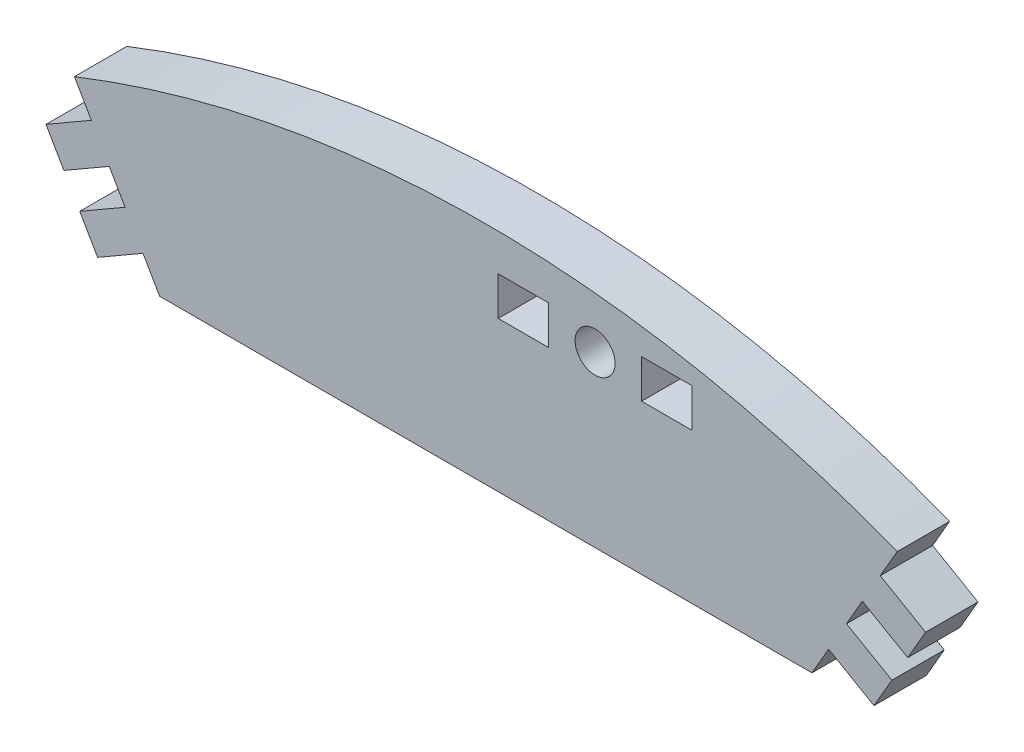
ISO-10303-21;
HEADER;
FILE_DESCRIPTION(('STEP AP214'),'2;1');
FILE_NAME('part.step','',(''),(''),'','','');
FILE_SCHEMA(('AUTOMOTIVE_DESIGN { 1 0 10303 214 1 1 1 1 }'));
ENDSEC;
DATA;
#1=APPLICATION_CONTEXT('core data for automotive mechanical design processes');
#2=APPLICATION_PROTOCOL_DEFINITION('international standard','automotive_design',2000,#1);
#3=PRODUCT_CONTEXT('',#1,'mechanical');
#4=PRODUCT('Part','Part','',(#3));
#5=PRODUCT_RELATED_PRODUCT_CATEGORY('part','',(#4));
#6=PRODUCT_DEFINITION_FORMATION('','',#4);
#7=PRODUCT_DEFINITION_CONTEXT('part definition',#1,'design');
#8=PRODUCT_DEFINITION('design','',#6,#7);
#9=PRODUCT_DEFINITION_SHAPE('','',#8);
#10=(LENGTH_UNIT() NAMED_UNIT(*) SI_UNIT(.MILLI.,.METRE.));
#11=(NAMED_UNIT(*) PLANE_ANGLE_UNIT() SI_UNIT($,.RADIAN.));
#12=(NAMED_UNIT(*) SI_UNIT($,.STERADIAN.) SOLID_ANGLE_UNIT());
#13=UNCERTAINTY_MEASURE_WITH_UNIT(LENGTH_MEASURE(1.E-05),#10,'distance_accuracy_value','');
#14=(GEOMETRIC_REPRESENTATION_CONTEXT(3) GLOBAL_UNCERTAINTY_ASSIGNED_CONTEXT((#13)) GLOBAL_UNIT_ASSIGNED_CONTEXT((#10,
#11,#12)) REPRESENTATION_CONTEXT('',''));
#15=CARTESIAN_POINT('',(0.,0.,0.));
#16=DIRECTION('',(0.,0.,1.));
#17=DIRECTION('',(1.,0.,0.));
#18=AXIS2_PLACEMENT_3D('',#15,#16,#17);
#19=CARTESIAN_POINT('',(0.,0.,5.15));
#20=DIRECTION('',(0.,0.,-1.));
#21=DIRECTION('',(-1.,0.,0.));
#22=AXIS2_PLACEMENT_3D('',#19,#20,#21);
#23=PLANE('',#22);
#24=DIRECTION('',(1.,0.,0.));
#25=VECTOR('',#24,1.);
#26=CARTESIAN_POINT('',(0.,106.45055836699,5.15));
#27=LINE('',#26,#25);
#28=CARTESIAN_POINT('',(1.21816936178716,106.45055836699,5.15));
#29=VERTEX_POINT('',#28);
#30=CARTESIAN_POINT('',(6.16816936178716,106.45055836699,5.15));
#31=VERTEX_POINT('',#30);
#32=EDGE_CURVE('E258',#29,#31,#27,.T.);
#33=ORIENTED_EDGE('',*,*,#32,.T.);
#34=DIRECTION('',(0.,-1.,0.));
#35=VECTOR('',#34,1.);
#36=CARTESIAN_POINT('',(6.16816936178713,0.,5.15));
#37=LINE('',#36,#35);
#38=CARTESIAN_POINT('',(6.16816936178716,102.65055836699,5.15));
#39=VERTEX_POINT('',#38);
#40=EDGE_CURVE('E264',#31,#39,#37,.T.);
#41=ORIENTED_EDGE('',*,*,#40,.T.);
#42=DIRECTION('',(1.,0.,0.));
#43=VECTOR('',#42,1.);
#44=CARTESIAN_POINT('',(0.,102.65055836699,5.15));
#45=LINE('',#44,#43);
#46=CARTESIAN_POINT('',(1.21816936178716,102.65055836699,5.15));
#47=VERTEX_POINT('',#46);
#48=EDGE_CURVE('E278',#47,#39,#45,.T.);
#49=ORIENTED_EDGE('',*,*,#48,.F.);
#50=DIRECTION('',(0.,-1.,0.));
#51=VECTOR('',#50,1.);
#52=CARTESIAN_POINT('',(1.21816936178716,0.,5.15));
#53=LINE('',#52,#51);
#54=EDGE_CURVE('E275',#29,#47,#53,.T.);
#55=ORIENTED_EDGE('',*,*,#54,.F.);
#56=EDGE_LOOP('',(#33,#41,#49,#55));
#57=FACE_BOUND('',#56,.T.);
#58=DIRECTION('',(0.499999999999999,-0.866025403784439,0.));
#59=VECTOR('',#58,1.);
#60=CARTESIAN_POINT('',(-32.057735026919,87.9,5.15));
#61=LINE('',#60,#59);
#62=CARTESIAN_POINT('',(-33.6943323793796,90.7346697659945,5.15));
#63=VERTEX_POINT('',#62);
#64=CARTESIAN_POINT('',(-32.057735026919,87.9,5.15));
#65=VERTEX_POINT('',#64);
#66=EDGE_CURVE('E293',#63,#65,#61,.T.);
#67=ORIENTED_EDGE('',*,*,#66,.T.);
#68=DIRECTION('',(1.,0.,0.));
#69=VECTOR('',#68,1.);
#70=CARTESIAN_POINT('',(-32.057735026919,87.9,5.15));
#71=LINE('',#70,#69);
#72=CARTESIAN_POINT('',(32.057735026919,87.9,5.15));
#73=VERTEX_POINT('',#72);
#74=EDGE_CURVE('E296',#65,#73,#71,.T.);
#75=ORIENTED_EDGE('',*,*,#74,.T.);
#76=DIRECTION('',(0.500000000000001,0.866025403784438,0.));
#77=VECTOR('',#76,1.);
#78=CARTESIAN_POINT('',(32.057735026919,87.9,5.15));
#79=LINE('',#78,#77);
#80=CARTESIAN_POINT('',(33.6943323793796,90.7346697659945,5.15));
#81=VERTEX_POINT('',#80);
#82=EDGE_CURVE('E299',#73,#81,#79,.T.);
#83=ORIENTED_EDGE('',*,*,#82,.T.);
#84=DIRECTION('',(0.866025403784439,-0.499999999999999,0.));
#85=VECTOR('',#84,1.);
#86=CARTESIAN_POINT('',(33.6943323793796,90.7346697659945,5.15));
#87=LINE('',#86,#85);
#88=CARTESIAN_POINT('',(38.1543632088694,88.1596697659945,5.15));
#89=VERTEX_POINT('',#88);
#90=EDGE_CURVE('E301',#81,#89,#87,.T.);
#91=ORIENTED_EDGE('',*,*,#90,.T.);
#92=DIRECTION('',(0.499999999999999,0.866025403784439,0.));
#93=VECTOR('',#92,1.);
#94=CARTESIAN_POINT('',(38.1543632088694,88.1596697659945,5.15));
#95=LINE('',#94,#93);
#96=CARTESIAN_POINT('',(39.9120930478705,91.2041471531243,5.15));
#97=VERTEX_POINT('',#96);
#98=EDGE_CURVE('E303',#89,#97,#95,.T.);
#99=ORIENTED_EDGE('',*,*,#98,.T.);
#100=DIRECTION('',(-0.866025403784438,0.5,0.));
#101=VECTOR('',#100,1.);
#102=CARTESIAN_POINT('',(39.9120930478705,91.2041471531243,5.15));
#103=LINE('',#102,#101);
#104=CARTESIAN_POINT('',(35.4520622183807,93.7791471531243,5.15));
#105=VERTEX_POINT('',#104);
#106=EDGE_CURVE('E305',#97,#105,#103,.T.);
#107=ORIENTED_EDGE('',*,*,#106,.T.);
#108=DIRECTION('',(0.5,0.866025403784438,0.));
#109=VECTOR('',#108,1.);
#110=CARTESIAN_POINT('',(35.4520622183807,93.7791471531243,5.15));
#111=LINE('',#110,#109);
#112=CARTESIAN_POINT('',(37.0097920573818,96.4772143787403,5.15));
#113=VERTEX_POINT('',#112);
#114=EDGE_CURVE('E307',#105,#113,#111,.T.);
#115=ORIENTED_EDGE('',*,*,#114,.T.);
#116=DIRECTION('',(0.866025403784438,-0.500000000000001,0.));
#117=VECTOR('',#116,1.);
#118=CARTESIAN_POINT('',(37.0097920573818,96.4772143787403,5.15));
#119=LINE('',#118,#117);
#120=CARTESIAN_POINT('',(41.4698228868716,93.9022143787403,5.15));
#121=VERTEX_POINT('',#120);
#122=EDGE_CURVE('E309',#113,#121,#119,.T.);
#123=ORIENTED_EDGE('',*,*,#122,.T.);
#124=DIRECTION('',(0.499999999999998,0.86602540378444,0.));
#125=VECTOR('',#124,1.);
#126=CARTESIAN_POINT('',(41.4698228868716,93.9022143787403,5.15));
#127=LINE('',#126,#125);
#128=CARTESIAN_POINT('',(43.2275527258728,96.9466917658701,5.15));
#129=VERTEX_POINT('',#128);
#130=EDGE_CURVE('E311',#121,#129,#127,.T.);
#131=ORIENTED_EDGE('',*,*,#130,.T.);
#132=DIRECTION('',(-0.866025403784439,0.499999999999999,0.));
#133=VECTOR('',#132,1.);
#134=CARTESIAN_POINT('',(43.2275527258728,96.9466917658701,5.15));
#135=LINE('',#134,#133);
#136=CARTESIAN_POINT('',(38.7675218963829,99.5216917658701,5.15));
#137=VERTEX_POINT('',#136);
#138=EDGE_CURVE('E313',#129,#137,#135,.T.);
#139=ORIENTED_EDGE('',*,*,#138,.T.);
#140=DIRECTION('',(0.499999999999998,0.86602540378444,0.));
#141=VECTOR('',#140,1.);
#142=CARTESIAN_POINT('',(38.7675218963829,99.5216917658701,5.15));
#143=LINE('',#142,#141);
#144=CARTESIAN_POINT('',(40.4332638413848,102.406841446912,5.15));
#145=VERTEX_POINT('',#144);
#146=EDGE_CURVE('E315',#137,#145,#143,.T.);
#147=ORIENTED_EDGE('',*,*,#146,.T.);
#148=CARTESIAN_POINT('',(0.,0.,5.15));
#149=DIRECTION('',(0.,0.,1.));
#150=DIRECTION('',(-1.,0.,0.));
#151=AXIS2_PLACEMENT_3D('',#148,#149,#150);
#152=CIRCLE('',#151,110.1);
#153=CARTESIAN_POINT('',(-40.4332638413848,102.406841446912,5.15));
#154=VERTEX_POINT('',#153);
#155=EDGE_CURVE('E317',#145,#154,#152,.T.);
#156=ORIENTED_EDGE('',*,*,#155,.T.);
#157=DIRECTION('',(0.499999999999998,-0.86602540378444,0.));
#158=VECTOR('',#157,1.);
#159=CARTESIAN_POINT('',(-38.7675218963829,99.5216917658701,5.15));
#160=LINE('',#159,#158);
#161=CARTESIAN_POINT('',(-38.7675218963829,99.5216917658701,5.15));
#162=VERTEX_POINT('',#161);
#163=EDGE_CURVE('E319',#154,#162,#160,.T.);
#164=ORIENTED_EDGE('',*,*,#163,.T.);
#165=DIRECTION('',(-0.866025403784439,-0.499999999999999,0.));
#166=VECTOR('',#165,1.);
#167=CARTESIAN_POINT('',(-43.2275527258728,96.9466917658701,5.15));
#168=LINE('',#167,#166);
#169=CARTESIAN_POINT('',(-43.2275527258728,96.9466917658701,5.15));
#170=VERTEX_POINT('',#169);
#171=EDGE_CURVE('E321',#162,#170,#168,.T.);
#172=ORIENTED_EDGE('',*,*,#171,.T.);
#173=DIRECTION('',(0.499999999999998,-0.86602540378444,0.));
#174=VECTOR('',#173,1.);
#175=CARTESIAN_POINT('',(-41.4698228868716,93.9022143787403,5.15));
#176=LINE('',#175,#174);
#177=CARTESIAN_POINT('',(-41.4698228868716,93.9022143787403,5.15));
#178=VERTEX_POINT('',#177);
#179=EDGE_CURVE('E323',#170,#178,#176,.T.);
#180=ORIENTED_EDGE('',*,*,#179,.T.);
#181=DIRECTION('',(0.866025403784438,0.500000000000001,0.));
#182=VECTOR('',#181,1.);
#183=CARTESIAN_POINT('',(-37.0097920573818,96.4772143787403,5.15));
#184=LINE('',#183,#182);
#185=CARTESIAN_POINT('',(-37.0097920573818,96.4772143787403,5.15));
#186=VERTEX_POINT('',#185);
#187=EDGE_CURVE('E325',#178,#186,#184,.T.);
#188=ORIENTED_EDGE('',*,*,#187,.T.);
#189=DIRECTION('',(0.5,-0.866025403784438,0.));
#190=VECTOR('',#189,1.);
#191=CARTESIAN_POINT('',(-35.4520622183807,93.7791471531243,5.15));
#192=LINE('',#191,#190);
#193=CARTESIAN_POINT('',(-35.4520622183807,93.7791471531243,5.15));
#194=VERTEX_POINT('',#193);
#195=EDGE_CURVE('E327',#186,#194,#192,.T.);
#196=ORIENTED_EDGE('',*,*,#195,.T.);
#197=DIRECTION('',(-0.866025403784438,-0.5,0.));
#198=VECTOR('',#197,1.);
#199=CARTESIAN_POINT('',(-39.9120930478705,91.2041471531243,5.15));
#200=LINE('',#199,#198);
#201=CARTESIAN_POINT('',(-39.9120930478705,91.2041471531243,5.15));
#202=VERTEX_POINT('',#201);
#203=EDGE_CURVE('E329',#194,#202,#200,.T.);
#204=ORIENTED_EDGE('',*,*,#203,.T.);
#205=DIRECTION('',(0.499999999999999,-0.866025403784439,0.));
#206=VECTOR('',#205,1.);
#207=CARTESIAN_POINT('',(-38.1543632088694,88.1596697659945,5.15));
#208=LINE('',#207,#206);
#209=CARTESIAN_POINT('',(-38.1543632088694,88.1596697659945,5.15));
#210=VERTEX_POINT('',#209);
#211=EDGE_CURVE('E331',#202,#210,#208,.T.);
#212=ORIENTED_EDGE('',*,*,#211,.T.);
#213=DIRECTION('',(0.866025403784438,0.500000000000001,0.));
#214=VECTOR('',#213,1.);
#215=CARTESIAN_POINT('',(-33.6943323793796,90.7346697659945,5.15));
#216=LINE('',#215,#214);
#217=EDGE_CURVE('E333',#210,#63,#216,.T.);
#218=ORIENTED_EDGE('',*,*,#217,.T.);
#219=EDGE_LOOP('',(#67,#75,#83,#91,#99,#107,#115,#123,#131,#139,#147,#156,#164,#172,#180,#188,
#196,#204,#212,#218));
#220=FACE_BOUND('',#219,.T.);
#221=CARTESIAN_POINT('',(10.74,104.55055836699,5.15));
#222=DIRECTION('',(0.,0.,1.));
#223=DIRECTION('',(1.,0.,0.));
#224=AXIS2_PLACEMENT_3D('',#221,#222,#223);
#225=CIRCLE('',#224,1.96749999999999);
#226=CARTESIAN_POINT('',(12.7075,104.55055836699,5.15));
#227=VERTEX_POINT('',#226);
#228=EDGE_CURVE('E251',#227,#227,#225,.T.);
#229=ORIENTED_EDGE('',*,*,#228,.F.);
#230=EDGE_LOOP('',(#229));
#231=FACE_BOUND('',#230,.T.);
#232=DIRECTION('',(1.,0.,0.));
#233=VECTOR('',#232,1.);
#234=CARTESIAN_POINT('',(0.,106.45055836699,5.15));
#235=LINE('',#234,#233);
#236=CARTESIAN_POINT('',(15.3118306382128,106.45055836699,5.15));
#237=VERTEX_POINT('',#236);
#238=CARTESIAN_POINT('',(20.2618306382128,106.45055836699,5.15));
#239=VERTEX_POINT('',#238);
#240=EDGE_CURVE('E48',#237,#239,#235,.T.);
#241=ORIENTED_EDGE('',*,*,#240,.T.);
#242=DIRECTION('',(0.,-1.,0.));
#243=VECTOR('',#242,1.);
#244=CARTESIAN_POINT('',(20.2618306382128,0.,5.15));
#245=LINE('',#244,#243);
#246=CARTESIAN_POINT('',(20.2618306382128,102.65055836699,5.15));
#247=VERTEX_POINT('',#246);
#248=EDGE_CURVE('E236',#239,#247,#245,.T.);
#249=ORIENTED_EDGE('',*,*,#248,.T.);
#250=DIRECTION('',(1.,0.,0.));
#251=VECTOR('',#250,1.);
#252=CARTESIAN_POINT('',(0.,102.65055836699,5.15));
#253=LINE('',#252,#251);
#254=CARTESIAN_POINT('',(15.3118306382128,102.65055836699,5.15));
#255=VERTEX_POINT('',#254);
#256=EDGE_CURVE('E239',#255,#247,#253,.T.);
#257=ORIENTED_EDGE('',*,*,#256,.F.);
#258=DIRECTION('',(0.,-1.,0.));
#259=VECTOR('',#258,1.);
#260=CARTESIAN_POINT('',(15.3118306382128,0.,5.15));
#261=LINE('',#260,#259);
#262=EDGE_CURVE('E245',#237,#255,#261,.T.);
#263=ORIENTED_EDGE('',*,*,#262,.F.);
#264=EDGE_LOOP('',(#241,#249,#257,#263));
#265=FACE_BOUND('',#264,.T.);
#266=ADVANCED_FACE('F33',(#57,#220,#231,#265),#23,.F.);
#267=CARTESIAN_POINT('',(0.,0.,0.));
#268=DIRECTION('',(0.,0.,-1.));
#269=DIRECTION('',(-1.,0.,0.));
#270=AXIS2_PLACEMENT_3D('',#267,#268,#269);
#271=PLANE('',#270);
#272=DIRECTION('',(0.,-1.,0.));
#273=VECTOR('',#272,1.);
#274=CARTESIAN_POINT('',(6.16816936178713,0.,0.));
#275=LINE('',#274,#273);
#276=CARTESIAN_POINT('',(6.16816936178716,106.45055836699,0.));
#277=VERTEX_POINT('',#276);
#278=CARTESIAN_POINT('',(6.16816936178716,102.65055836699,0.));
#279=VERTEX_POINT('',#278);
#280=EDGE_CURVE('E270',#277,#279,#275,.T.);
#281=ORIENTED_EDGE('',*,*,#280,.F.);
#282=DIRECTION('',(1.,0.,0.));
#283=VECTOR('',#282,1.);
#284=CARTESIAN_POINT('',(0.,106.45055836699,0.));
#285=LINE('',#284,#283);
#286=CARTESIAN_POINT('',(1.21816936178716,106.45055836699,0.));
#287=VERTEX_POINT('',#286);
#288=EDGE_CURVE('E261',#287,#277,#285,.T.);
#289=ORIENTED_EDGE('',*,*,#288,.F.);
#290=DIRECTION('',(0.,-1.,0.));
#291=VECTOR('',#290,1.);
#292=CARTESIAN_POINT('',(1.21816936178716,0.,0.));
#293=LINE('',#292,#291);
#294=CARTESIAN_POINT('',(1.21816936178716,102.65055836699,0.));
#295=VERTEX_POINT('',#294);
#296=EDGE_CURVE('E263',#287,#295,#293,.T.);
#297=ORIENTED_EDGE('',*,*,#296,.T.);
#298=DIRECTION('',(1.,0.,0.));
#299=VECTOR('',#298,1.);
#300=CARTESIAN_POINT('',(0.,102.65055836699,0.));
#301=LINE('',#300,#299);
#302=EDGE_CURVE('E267',#295,#279,#301,.T.);
#303=ORIENTED_EDGE('',*,*,#302,.T.);
#304=EDGE_LOOP('',(#281,#289,#297,#303));
#305=FACE_BOUND('',#304,.T.);
#306=DIRECTION('',(0.499999999999999,-0.866025403784439,0.));
#307=VECTOR('',#306,1.);
#308=CARTESIAN_POINT('',(-32.057735026919,87.9,0.));
#309=LINE('',#308,#307);
#310=CARTESIAN_POINT('',(-33.6943323793796,90.7346697659945,0.));
#311=VERTEX_POINT('',#310);
#312=CARTESIAN_POINT('',(-32.057735026919,87.9,0.));
#313=VERTEX_POINT('',#312);
#314=EDGE_CURVE('E286',#311,#313,#309,.T.);
#315=ORIENTED_EDGE('',*,*,#314,.F.);
#316=DIRECTION('',(0.866025403784438,0.500000000000001,0.));
#317=VECTOR('',#316,1.);
#318=CARTESIAN_POINT('',(-33.6943323793796,90.7346697659945,0.));
#319=LINE('',#318,#317);
#320=CARTESIAN_POINT('',(-38.1543632088694,88.1596697659945,0.));
#321=VERTEX_POINT('',#320);
#322=EDGE_CURVE('E297',#321,#311,#319,.T.);
#323=ORIENTED_EDGE('',*,*,#322,.F.);
#324=DIRECTION('',(0.499999999999999,-0.866025403784439,0.));
#325=VECTOR('',#324,1.);
#326=CARTESIAN_POINT('',(-38.1543632088694,88.1596697659945,0.));
#327=LINE('',#326,#325);
#328=CARTESIAN_POINT('',(-39.9120930478705,91.2041471531243,0.));
#329=VERTEX_POINT('',#328);
#330=EDGE_CURVE('E372',#329,#321,#327,.T.);
#331=ORIENTED_EDGE('',*,*,#330,.F.);
#332=DIRECTION('',(-0.866025403784438,-0.5,0.));
#333=VECTOR('',#332,1.);
#334=CARTESIAN_POINT('',(-39.9120930478705,91.2041471531243,0.));
#335=LINE('',#334,#333);
#336=CARTESIAN_POINT('',(-35.4520622183807,93.7791471531243,0.));
#337=VERTEX_POINT('',#336);
#338=EDGE_CURVE('E370',#337,#329,#335,.T.);
#339=ORIENTED_EDGE('',*,*,#338,.F.);
#340=DIRECTION('',(0.5,-0.866025403784438,0.));
#341=VECTOR('',#340,1.);
#342=CARTESIAN_POINT('',(-35.4520622183807,93.7791471531243,0.));
#343=LINE('',#342,#341);
#344=CARTESIAN_POINT('',(-37.0097920573818,96.4772143787403,0.));
#345=VERTEX_POINT('',#344);
#346=EDGE_CURVE('E368',#345,#337,#343,.T.);
#347=ORIENTED_EDGE('',*,*,#346,.F.);
#348=DIRECTION('',(0.866025403784438,0.500000000000001,0.));
#349=VECTOR('',#348,1.);
#350=CARTESIAN_POINT('',(-37.0097920573818,96.4772143787403,0.));
#351=LINE('',#350,#349);
#352=CARTESIAN_POINT('',(-41.4698228868716,93.9022143787403,0.));
#353=VERTEX_POINT('',#352);
#354=EDGE_CURVE('E366',#353,#345,#351,.T.);
#355=ORIENTED_EDGE('',*,*,#354,.F.);
#356=DIRECTION('',(0.499999999999998,-0.86602540378444,0.));
#357=VECTOR('',#356,1.);
#358=CARTESIAN_POINT('',(-41.4698228868716,93.9022143787403,0.));
#359=LINE('',#358,#357);
#360=CARTESIAN_POINT('',(-43.2275527258728,96.9466917658701,0.));
#361=VERTEX_POINT('',#360);
#362=EDGE_CURVE('E364',#361,#353,#359,.T.);
#363=ORIENTED_EDGE('',*,*,#362,.F.);
#364=DIRECTION('',(-0.866025403784439,-0.499999999999999,0.));
#365=VECTOR('',#364,1.);
#366=CARTESIAN_POINT('',(-43.2275527258728,96.9466917658701,0.));
#367=LINE('',#366,#365);
#368=CARTESIAN_POINT('',(-38.7675218963829,99.5216917658701,0.));
#369=VERTEX_POINT('',#368);
#370=EDGE_CURVE('E362',#369,#361,#367,.T.);
#371=ORIENTED_EDGE('',*,*,#370,.F.);
#372=DIRECTION('',(0.499999999999998,-0.86602540378444,0.));
#373=VECTOR('',#372,1.);
#374=CARTESIAN_POINT('',(-38.7675218963829,99.5216917658701,0.));
#375=LINE('',#374,#373);
#376=CARTESIAN_POINT('',(-40.4332638413848,102.406841446912,0.));
#377=VERTEX_POINT('',#376);
#378=EDGE_CURVE('E360',#377,#369,#375,.T.);
#379=ORIENTED_EDGE('',*,*,#378,.F.);
#380=CARTESIAN_POINT('',(0.,0.,0.));
#381=DIRECTION('',(0.,0.,1.));
#382=DIRECTION('',(-1.,0.,0.));
#383=AXIS2_PLACEMENT_3D('',#380,#381,#382);
#384=CIRCLE('',#383,110.1);
#385=CARTESIAN_POINT('',(40.4332638413848,102.406841446912,0.));
#386=VERTEX_POINT('',#385);
#387=EDGE_CURVE('E358',#386,#377,#384,.T.);
#388=ORIENTED_EDGE('',*,*,#387,.F.);
#389=DIRECTION('',(0.499999999999998,0.86602540378444,0.));
#390=VECTOR('',#389,1.);
#391=CARTESIAN_POINT('',(38.7675218963829,99.5216917658701,0.));
#392=LINE('',#391,#390);
#393=CARTESIAN_POINT('',(38.7675218963829,99.5216917658701,0.));
#394=VERTEX_POINT('',#393);
#395=EDGE_CURVE('E356',#394,#386,#392,.T.);
#396=ORIENTED_EDGE('',*,*,#395,.F.);
#397=DIRECTION('',(-0.866025403784439,0.499999999999999,0.));
#398=VECTOR('',#397,1.);
#399=CARTESIAN_POINT('',(43.2275527258728,96.9466917658701,0.));
#400=LINE('',#399,#398);
#401=CARTESIAN_POINT('',(43.2275527258728,96.9466917658701,0.));
#402=VERTEX_POINT('',#401);
#403=EDGE_CURVE('E354',#402,#394,#400,.T.);
#404=ORIENTED_EDGE('',*,*,#403,.F.);
#405=DIRECTION('',(0.499999999999998,0.86602540378444,0.));
#406=VECTOR('',#405,1.);
#407=CARTESIAN_POINT('',(41.4698228868716,93.9022143787403,0.));
#408=LINE('',#407,#406);
#409=CARTESIAN_POINT('',(41.4698228868716,93.9022143787403,0.));
#410=VERTEX_POINT('',#409);
#411=EDGE_CURVE('E352',#410,#402,#408,.T.);
#412=ORIENTED_EDGE('',*,*,#411,.F.);
#413=DIRECTION('',(0.866025403784438,-0.500000000000001,0.));
#414=VECTOR('',#413,1.);
#415=CARTESIAN_POINT('',(37.0097920573818,96.4772143787403,0.));
#416=LINE('',#415,#414);
#417=CARTESIAN_POINT('',(37.0097920573818,96.4772143787403,0.));
#418=VERTEX_POINT('',#417);
#419=EDGE_CURVE('E350',#418,#410,#416,.T.);
#420=ORIENTED_EDGE('',*,*,#419,.F.);
#421=DIRECTION('',(0.5,0.866025403784438,0.));
#422=VECTOR('',#421,1.);
#423=CARTESIAN_POINT('',(35.4520622183807,93.7791471531243,0.));
#424=LINE('',#423,#422);
#425=CARTESIAN_POINT('',(35.4520622183807,93.7791471531243,0.));
#426=VERTEX_POINT('',#425);
#427=EDGE_CURVE('E348',#426,#418,#424,.T.);
#428=ORIENTED_EDGE('',*,*,#427,.F.);
#429=DIRECTION('',(-0.866025403784438,0.5,0.));
#430=VECTOR('',#429,1.);
#431=CARTESIAN_POINT('',(39.9120930478705,91.2041471531243,0.));
#432=LINE('',#431,#430);
#433=CARTESIAN_POINT('',(39.9120930478705,91.2041471531243,0.));
#434=VERTEX_POINT('',#433);
#435=EDGE_CURVE('E346',#434,#426,#432,.T.);
#436=ORIENTED_EDGE('',*,*,#435,.F.);
#437=DIRECTION('',(0.499999999999999,0.866025403784439,0.));
#438=VECTOR('',#437,1.);
#439=CARTESIAN_POINT('',(38.1543632088694,88.1596697659945,0.));
#440=LINE('',#439,#438);
#441=CARTESIAN_POINT('',(38.1543632088694,88.1596697659945,0.));
#442=VERTEX_POINT('',#441);
#443=EDGE_CURVE('E344',#442,#434,#440,.T.);
#444=ORIENTED_EDGE('',*,*,#443,.F.);
#445=DIRECTION('',(0.866025403784439,-0.499999999999999,0.));
#446=VECTOR('',#445,1.);
#447=CARTESIAN_POINT('',(33.6943323793796,90.7346697659945,0.));
#448=LINE('',#447,#446);
#449=CARTESIAN_POINT('',(33.6943323793796,90.7346697659945,0.));
#450=VERTEX_POINT('',#449);
#451=EDGE_CURVE('E342',#450,#442,#448,.T.);
#452=ORIENTED_EDGE('',*,*,#451,.F.);
#453=DIRECTION('',(0.500000000000001,0.866025403784438,0.));
#454=VECTOR('',#453,1.);
#455=CARTESIAN_POINT('',(32.057735026919,87.9,0.));
#456=LINE('',#455,#454);
#457=CARTESIAN_POINT('',(32.057735026919,87.9,0.));
#458=VERTEX_POINT('',#457);
#459=EDGE_CURVE('E340',#458,#450,#456,.T.);
#460=ORIENTED_EDGE('',*,*,#459,.F.);
#461=DIRECTION('',(1.,0.,0.));
#462=VECTOR('',#461,1.);
#463=CARTESIAN_POINT('',(-32.057735026919,87.9,0.));
#464=LINE('',#463,#462);
#465=EDGE_CURVE('E338',#313,#458,#464,.T.);
#466=ORIENTED_EDGE('',*,*,#465,.F.);
#467=EDGE_LOOP('',(#315,#323,#331,#339,#347,#355,#363,#371,#379,#388,#396,#404,#412,#420,#428,
#436,#444,#452,#460,#466));
#468=FACE_BOUND('',#467,.T.);
#469=CARTESIAN_POINT('',(10.74,104.55055836699,0.));
#470=DIRECTION('',(0.,0.,1.));
#471=DIRECTION('',(1.,0.,0.));
#472=AXIS2_PLACEMENT_3D('',#469,#470,#471);
#473=CIRCLE('',#472,1.96749999999999);
#474=CARTESIAN_POINT('',(12.7075,104.55055836699,0.));
#475=VERTEX_POINT('',#474);
#476=EDGE_CURVE('E255',#475,#475,#473,.T.);
#477=ORIENTED_EDGE('',*,*,#476,.T.);
#478=EDGE_LOOP('',(#477));
#479=FACE_BOUND('',#478,.T.);
#480=DIRECTION('',(0.,-1.,0.));
#481=VECTOR('',#480,1.);
#482=CARTESIAN_POINT('',(20.2618306382128,0.,0.));
#483=LINE('',#482,#481);
#484=CARTESIAN_POINT('',(20.2618306382128,106.45055836699,0.));
#485=VERTEX_POINT('',#484);
#486=CARTESIAN_POINT('',(20.2618306382128,102.65055836699,0.));
#487=VERTEX_POINT('',#486);
#488=EDGE_CURVE('E227',#485,#487,#483,.T.);
#489=ORIENTED_EDGE('',*,*,#488,.F.);
#490=DIRECTION('',(1.,0.,0.));
#491=VECTOR('',#490,1.);
#492=CARTESIAN_POINT('',(0.,106.45055836699,0.));
#493=LINE('',#492,#491);
#494=CARTESIAN_POINT('',(15.3118306382128,106.45055836699,0.));
#495=VERTEX_POINT('',#494);
#496=EDGE_CURVE('E221',#495,#485,#493,.T.);
#497=ORIENTED_EDGE('',*,*,#496,.F.);
#498=DIRECTION('',(0.,-1.,0.));
#499=VECTOR('',#498,1.);
#500=CARTESIAN_POINT('',(15.3118306382128,0.,0.));
#501=LINE('',#500,#499);
#502=CARTESIAN_POINT('',(15.3118306382128,102.65055836699,0.));
#503=VERTEX_POINT('',#502);
#504=EDGE_CURVE('E230',#495,#503,#501,.T.);
#505=ORIENTED_EDGE('',*,*,#504,.T.);
#506=DIRECTION('',(1.,0.,0.));
#507=VECTOR('',#506,1.);
#508=CARTESIAN_POINT('',(0.,102.65055836699,0.));
#509=LINE('',#508,#507);
#510=EDGE_CURVE('E56',#503,#487,#509,.T.);
#511=ORIENTED_EDGE('',*,*,#510,.T.);
#512=EDGE_LOOP('',(#489,#497,#505,#511));
#513=FACE_BOUND('',#512,.T.);
#514=ADVANCED_FACE('F235',(#305,#468,#479,#513),#271,.T.);
#515=CARTESIAN_POINT('',(-32.057735026919,87.9,5.15));
#516=DIRECTION('',(0.866025403784439,0.499999999999999,0.));
#517=DIRECTION('',(-0.499999999999999,0.866025403784439,0.));
#518=AXIS2_PLACEMENT_3D('',#515,#516,#517);
#519=PLANE('',#518);
#520=ORIENTED_EDGE('',*,*,#314,.T.);
#521=DIRECTION('',(0.,0.,-1.));
#522=VECTOR('',#521,1.);
#523=CARTESIAN_POINT('',(-32.057735026919,87.9,5.15));
#524=LINE('',#523,#522);
#525=EDGE_CURVE('E11',#65,#313,#524,.T.);
#526=ORIENTED_EDGE('',*,*,#525,.F.);
#527=ORIENTED_EDGE('',*,*,#66,.F.);
#528=DIRECTION('',(0.,0.,-1.));
#529=VECTOR('',#528,1.);
#530=CARTESIAN_POINT('',(-33.6943323793796,90.7346697659945,5.15));
#531=LINE('',#530,#529);
#532=EDGE_CURVE('E335',#63,#311,#531,.T.);
#533=ORIENTED_EDGE('',*,*,#532,.T.);
#534=EDGE_LOOP('',(#520,#526,#527,#533));
#535=FACE_BOUND('',#534,.T.);
#536=ADVANCED_FACE('F35',(#535),#519,.F.);
#537=CARTESIAN_POINT('',(-32.057735026919,87.9,5.15));
#538=DIRECTION('',(0.,1.,0.));
#539=DIRECTION('',(0.,0.,1.));
#540=AXIS2_PLACEMENT_3D('',#537,#538,#539);
#541=PLANE('',#540);
#542=ORIENTED_EDGE('',*,*,#465,.T.);
#543=DIRECTION('',(0.,0.,-1.));
#544=VECTOR('',#543,1.);
#545=CARTESIAN_POINT('',(32.057735026919,87.9,5.15));
#546=LINE('',#545,#544);
#547=EDGE_CURVE('E41',#73,#458,#546,.T.);
#548=ORIENTED_EDGE('',*,*,#547,.F.);
#549=ORIENTED_EDGE('',*,*,#74,.F.);
#550=ORIENTED_EDGE('',*,*,#525,.T.);
#551=EDGE_LOOP('',(#542,#548,#549,#550));
#552=FACE_BOUND('',#551,.T.);
#553=ADVANCED_FACE('F455',(#552),#541,.F.);
#554=CARTESIAN_POINT('',(32.057735026919,87.9,5.15));
#555=DIRECTION('',(-0.866025403784438,0.500000000000001,0.));
#556=DIRECTION('',(-0.500000000000001,-0.866025403784438,0.));
#557=AXIS2_PLACEMENT_3D('',#554,#555,#556);
#558=PLANE('',#557);
#559=ORIENTED_EDGE('',*,*,#459,.T.);
#560=DIRECTION('',(0.,0.,-1.));
#561=VECTOR('',#560,1.);
#562=CARTESIAN_POINT('',(33.6943323793796,90.7346697659945,5.15));
#563=LINE('',#562,#561);
#564=EDGE_CURVE('E425',#81,#450,#563,.T.);
#565=ORIENTED_EDGE('',*,*,#564,.F.);
#566=ORIENTED_EDGE('',*,*,#82,.F.);
#567=ORIENTED_EDGE('',*,*,#547,.T.);
#568=EDGE_LOOP('',(#559,#565,#566,#567));
#569=FACE_BOUND('',#568,.T.);
#570=ADVANCED_FACE('F432',(#569),#558,.F.);
#571=CARTESIAN_POINT('',(33.6943323793796,90.7346697659945,5.15));
#572=DIRECTION('',(0.499999999999999,0.866025403784439,0.));
#573=DIRECTION('',(-0.866025403784439,0.5,0.));
#574=AXIS2_PLACEMENT_3D('',#571,#572,#573);
#575=PLANE('',#574);
#576=ORIENTED_EDGE('',*,*,#451,.T.);
#577=DIRECTION('',(0.,0.,-1.));
#578=VECTOR('',#577,1.);
#579=CARTESIAN_POINT('',(38.1543632088694,88.1596697659945,5.15));
#580=LINE('',#579,#578);
#581=EDGE_CURVE('E422',#89,#442,#580,.T.);
#582=ORIENTED_EDGE('',*,*,#581,.F.);
#583=ORIENTED_EDGE('',*,*,#90,.F.);
#584=ORIENTED_EDGE('',*,*,#564,.T.);
#585=EDGE_LOOP('',(#576,#582,#583,#584));
#586=FACE_BOUND('',#585,.T.);
#587=ADVANCED_FACE('F443',(#586),#575,.F.);
#588=CARTESIAN_POINT('',(38.1543632088694,88.1596697659945,5.15));
#589=DIRECTION('',(-0.866025403784439,0.499999999999999,0.));
#590=DIRECTION('',(-0.5,-0.866025403784439,0.));
#591=AXIS2_PLACEMENT_3D('',#588,#589,#590);
#592=PLANE('',#591);
#593=ORIENTED_EDGE('',*,*,#443,.T.);
#594=DIRECTION('',(0.,0.,-1.));
#595=VECTOR('',#594,1.);
#596=CARTESIAN_POINT('',(39.9120930478705,91.2041471531243,5.15));
#597=LINE('',#596,#595);
#598=EDGE_CURVE('E419',#97,#434,#597,.T.);
#599=ORIENTED_EDGE('',*,*,#598,.F.);
#600=ORIENTED_EDGE('',*,*,#98,.F.);
#601=ORIENTED_EDGE('',*,*,#581,.T.);
#602=EDGE_LOOP('',(#593,#599,#600,#601));
#603=FACE_BOUND('',#602,.T.);
#604=ADVANCED_FACE('F447',(#603),#592,.F.);
#605=CARTESIAN_POINT('',(39.9120930478705,91.2041471531243,5.15));
#606=DIRECTION('',(-0.5,-0.866025403784438,0.));
#607=DIRECTION('',(0.866025403784439,-0.5,0.));
#608=AXIS2_PLACEMENT_3D('',#605,#606,#607);
#609=PLANE('',#608);
#610=ORIENTED_EDGE('',*,*,#435,.T.);
#611=DIRECTION('',(0.,0.,-1.));
#612=VECTOR('',#611,1.);
#613=CARTESIAN_POINT('',(35.4520622183807,93.7791471531243,5.15));
#614=LINE('',#613,#612);
#615=EDGE_CURVE('E416',#105,#426,#614,.T.);
#616=ORIENTED_EDGE('',*,*,#615,.F.);
#617=ORIENTED_EDGE('',*,*,#106,.F.);
#618=ORIENTED_EDGE('',*,*,#598,.T.);
#619=EDGE_LOOP('',(#610,#616,#617,#618));
#620=FACE_BOUND('',#619,.T.);
#621=ADVANCED_FACE('F528',(#620),#609,.F.);
#622=CARTESIAN_POINT('',(35.4520622183807,93.7791471531243,5.15));
#623=DIRECTION('',(-0.866025403784438,0.5,0.));
#624=DIRECTION('',(-0.5,-0.866025403784439,0.));
#625=AXIS2_PLACEMENT_3D('',#622,#623,#624);
#626=PLANE('',#625);
#627=ORIENTED_EDGE('',*,*,#427,.T.);
#628=DIRECTION('',(0.,0.,-1.));
#629=VECTOR('',#628,1.);
#630=CARTESIAN_POINT('',(37.0097920573818,96.4772143787403,5.15));
#631=LINE('',#630,#629);
#632=EDGE_CURVE('E413',#113,#418,#631,.T.);
#633=ORIENTED_EDGE('',*,*,#632,.F.);
#634=ORIENTED_EDGE('',*,*,#114,.F.);
#635=ORIENTED_EDGE('',*,*,#615,.T.);
#636=EDGE_LOOP('',(#627,#633,#634,#635));
#637=FACE_BOUND('',#636,.T.);
#638=ADVANCED_FACE('F526',(#637),#626,.F.);
#639=CARTESIAN_POINT('',(37.0097920573818,96.4772143787403,5.15));
#640=DIRECTION('',(0.500000000000002,0.866025403784438,0.));
#641=DIRECTION('',(-0.866025403784438,0.500000000000001,0.));
#642=AXIS2_PLACEMENT_3D('',#639,#640,#641);
#643=PLANE('',#642);
#644=ORIENTED_EDGE('',*,*,#419,.T.);
#645=DIRECTION('',(0.,0.,-1.));
#646=VECTOR('',#645,1.);
#647=CARTESIAN_POINT('',(41.4698228868716,93.9022143787403,5.15));
#648=LINE('',#647,#646);
#649=EDGE_CURVE('E410',#121,#410,#648,.T.);
#650=ORIENTED_EDGE('',*,*,#649,.F.);
#651=ORIENTED_EDGE('',*,*,#122,.F.);
#652=ORIENTED_EDGE('',*,*,#632,.T.);
#653=EDGE_LOOP('',(#644,#650,#651,#652));
#654=FACE_BOUND('',#653,.T.);
#655=ADVANCED_FACE('F521',(#654),#643,.F.);
#656=CARTESIAN_POINT('',(41.4698228868716,93.9022143787403,5.15));
#657=DIRECTION('',(-0.86602540378444,0.499999999999998,0.));
#658=DIRECTION('',(-0.499999999999998,-0.86602540378444,0.));
#659=AXIS2_PLACEMENT_3D('',#656,#657,#658);
#660=PLANE('',#659);
#661=ORIENTED_EDGE('',*,*,#411,.T.);
#662=DIRECTION('',(0.,0.,-1.));
#663=VECTOR('',#662,1.);
#664=CARTESIAN_POINT('',(43.2275527258728,96.9466917658701,5.15));
#665=LINE('',#664,#663);
#666=EDGE_CURVE('E407',#129,#402,#665,.T.);
#667=ORIENTED_EDGE('',*,*,#666,.F.);
#668=ORIENTED_EDGE('',*,*,#130,.F.);
#669=ORIENTED_EDGE('',*,*,#649,.T.);
#670=EDGE_LOOP('',(#661,#667,#668,#669));
#671=FACE_BOUND('',#670,.T.);
#672=ADVANCED_FACE('F516',(#671),#660,.F.);
#673=CARTESIAN_POINT('',(43.2275527258728,96.9466917658701,5.15));
#674=DIRECTION('',(-0.499999999999999,-0.866025403784439,0.));
#675=DIRECTION('',(0.866025403784439,-0.499999999999999,0.));
#676=AXIS2_PLACEMENT_3D('',#673,#674,#675);
#677=PLANE('',#676);
#678=ORIENTED_EDGE('',*,*,#403,.T.);
#679=DIRECTION('',(0.,0.,-1.));
#680=VECTOR('',#679,1.);
#681=CARTESIAN_POINT('',(38.7675218963829,99.5216917658701,5.15));
#682=LINE('',#681,#680);
#683=EDGE_CURVE('E404',#137,#394,#682,.T.);
#684=ORIENTED_EDGE('',*,*,#683,.F.);
#685=ORIENTED_EDGE('',*,*,#138,.F.);
#686=ORIENTED_EDGE('',*,*,#666,.T.);
#687=EDGE_LOOP('',(#678,#684,#685,#686));
#688=FACE_BOUND('',#687,.T.);
#689=ADVANCED_FACE('F512',(#688),#677,.F.);
#690=CARTESIAN_POINT('',(38.7675218963829,99.5216917658701,5.15));
#691=DIRECTION('',(-0.86602540378444,0.499999999999998,0.));
#692=DIRECTION('',(-0.499999999999998,-0.86602540378444,0.));
#693=AXIS2_PLACEMENT_3D('',#690,#691,#692);
#694=PLANE('',#693);
#695=ORIENTED_EDGE('',*,*,#395,.T.);
#696=DIRECTION('',(0.,0.,-1.));
#697=VECTOR('',#696,1.);
#698=CARTESIAN_POINT('',(40.4332638413848,102.406841446912,5.15));
#699=LINE('',#698,#697);
#700=EDGE_CURVE('E401',#145,#386,#699,.T.);
#701=ORIENTED_EDGE('',*,*,#700,.F.);
#702=ORIENTED_EDGE('',*,*,#146,.F.);
#703=ORIENTED_EDGE('',*,*,#683,.T.);
#704=EDGE_LOOP('',(#695,#701,#702,#703));
#705=FACE_BOUND('',#704,.T.);
#706=ADVANCED_FACE('F507',(#705),#694,.F.);
#707=CARTESIAN_POINT('',(0.,0.,5.15));
#708=DIRECTION('',(0.,0.,-1.));
#709=DIRECTION('',(-1.,0.,0.));
#710=AXIS2_PLACEMENT_3D('',#707,#708,#709);
#711=CYLINDRICAL_SURFACE('',#710,110.1);
#712=ORIENTED_EDGE('',*,*,#387,.T.);
#713=DIRECTION('',(0.,0.,-1.));
#714=VECTOR('',#713,1.);
#715=CARTESIAN_POINT('',(-40.4332638413848,102.406841446912,5.15));
#716=LINE('',#715,#714);
#717=EDGE_CURVE('E398',#154,#377,#716,.T.);
#718=ORIENTED_EDGE('',*,*,#717,.F.);
#719=ORIENTED_EDGE('',*,*,#155,.F.);
#720=ORIENTED_EDGE('',*,*,#700,.T.);
#721=EDGE_LOOP('',(#712,#718,#719,#720));
#722=FACE_BOUND('',#721,.T.);
#723=ADVANCED_FACE('F501',(#722),#711,.T.);
#724=CARTESIAN_POINT('',(-38.7675218963829,99.5216917658701,5.15));
#725=DIRECTION('',(0.86602540378444,0.499999999999998,0.));
#726=DIRECTION('',(-0.499999999999998,0.86602540378444,0.));
#727=AXIS2_PLACEMENT_3D('',#724,#725,#726);
#728=PLANE('',#727);
#729=ORIENTED_EDGE('',*,*,#378,.T.);
#730=DIRECTION('',(0.,0.,-1.));
#731=VECTOR('',#730,1.);
#732=CARTESIAN_POINT('',(-38.7675218963829,99.5216917658701,5.15));
#733=LINE('',#732,#731);
#734=EDGE_CURVE('E395',#162,#369,#733,.T.);
#735=ORIENTED_EDGE('',*,*,#734,.F.);
#736=ORIENTED_EDGE('',*,*,#163,.F.);
#737=ORIENTED_EDGE('',*,*,#717,.T.);
#738=EDGE_LOOP('',(#729,#735,#736,#737));
#739=FACE_BOUND('',#738,.T.);
#740=ADVANCED_FACE('F497',(#739),#728,.F.);
#741=CARTESIAN_POINT('',(-43.2275527258728,96.9466917658701,5.15));
#742=DIRECTION('',(0.499999999999999,-0.866025403784439,0.));
#743=DIRECTION('',(0.866025403784439,0.499999999999999,0.));
#744=AXIS2_PLACEMENT_3D('',#741,#742,#743);
#745=PLANE('',#744);
#746=ORIENTED_EDGE('',*,*,#370,.T.);
#747=DIRECTION('',(0.,0.,-1.));
#748=VECTOR('',#747,1.);
#749=CARTESIAN_POINT('',(-43.2275527258728,96.9466917658701,5.15));
#750=LINE('',#749,#748);
#751=EDGE_CURVE('E392',#170,#361,#750,.T.);
#752=ORIENTED_EDGE('',*,*,#751,.F.);
#753=ORIENTED_EDGE('',*,*,#171,.F.);
#754=ORIENTED_EDGE('',*,*,#734,.T.);
#755=EDGE_LOOP('',(#746,#752,#753,#754));
#756=FACE_BOUND('',#755,.T.);
#757=ADVANCED_FACE('F492',(#756),#745,.F.);
#758=CARTESIAN_POINT('',(-41.4698228868716,93.9022143787403,5.15));
#759=DIRECTION('',(0.86602540378444,0.499999999999998,0.));
#760=DIRECTION('',(-0.499999999999998,0.86602540378444,0.));
#761=AXIS2_PLACEMENT_3D('',#758,#759,#760);
#762=PLANE('',#761);
#763=ORIENTED_EDGE('',*,*,#362,.T.);
#764=DIRECTION('',(0.,0.,-1.));
#765=VECTOR('',#764,1.);
#766=CARTESIAN_POINT('',(-41.4698228868716,93.9022143787403,5.15));
#767=LINE('',#766,#765);
#768=EDGE_CURVE('E389',#178,#353,#767,.T.);
#769=ORIENTED_EDGE('',*,*,#768,.F.);
#770=ORIENTED_EDGE('',*,*,#179,.F.);
#771=ORIENTED_EDGE('',*,*,#751,.T.);
#772=EDGE_LOOP('',(#763,#769,#770,#771));
#773=FACE_BOUND('',#772,.T.);
#774=ADVANCED_FACE('F486',(#773),#762,.F.);
#775=CARTESIAN_POINT('',(-37.0097920573818,96.4772143787403,5.15));
#776=DIRECTION('',(-0.500000000000002,0.866025403784438,0.));
#777=DIRECTION('',(-0.866025403784438,-0.500000000000001,0.));
#778=AXIS2_PLACEMENT_3D('',#775,#776,#777);
#779=PLANE('',#778);
#780=ORIENTED_EDGE('',*,*,#354,.T.);
#781=DIRECTION('',(0.,0.,-1.));
#782=VECTOR('',#781,1.);
#783=CARTESIAN_POINT('',(-37.0097920573818,96.4772143787403,5.15));
#784=LINE('',#783,#782);
#785=EDGE_CURVE('E386',#186,#345,#784,.T.);
#786=ORIENTED_EDGE('',*,*,#785,.F.);
#787=ORIENTED_EDGE('',*,*,#187,.F.);
#788=ORIENTED_EDGE('',*,*,#768,.T.);
#789=EDGE_LOOP('',(#780,#786,#787,#788));
#790=FACE_BOUND('',#789,.T.);
#791=ADVANCED_FACE('F482',(#790),#779,.F.);
#792=CARTESIAN_POINT('',(-35.4520622183807,93.7791471531243,5.15));
#793=DIRECTION('',(0.866025403784438,0.5,0.));
#794=DIRECTION('',(-0.5,0.866025403784439,0.));
#795=AXIS2_PLACEMENT_3D('',#792,#793,#794);
#796=PLANE('',#795);
#797=ORIENTED_EDGE('',*,*,#346,.T.);
#798=DIRECTION('',(0.,0.,-1.));
#799=VECTOR('',#798,1.);
#800=CARTESIAN_POINT('',(-35.4520622183807,93.7791471531243,5.15));
#801=LINE('',#800,#799);
#802=EDGE_CURVE('E383',#194,#337,#801,.T.);
#803=ORIENTED_EDGE('',*,*,#802,.F.);
#804=ORIENTED_EDGE('',*,*,#195,.F.);
#805=ORIENTED_EDGE('',*,*,#785,.T.);
#806=EDGE_LOOP('',(#797,#803,#804,#805));
#807=FACE_BOUND('',#806,.T.);
#808=ADVANCED_FACE('F477',(#807),#796,.F.);
#809=CARTESIAN_POINT('',(-39.9120930478705,91.2041471531243,5.15));
#810=DIRECTION('',(0.5,-0.866025403784438,0.));
#811=DIRECTION('',(0.866025403784439,0.5,0.));
#812=AXIS2_PLACEMENT_3D('',#809,#810,#811);
#813=PLANE('',#812);
#814=ORIENTED_EDGE('',*,*,#338,.T.);
#815=DIRECTION('',(0.,0.,-1.));
#816=VECTOR('',#815,1.);
#817=CARTESIAN_POINT('',(-39.9120930478705,91.2041471531243,5.15));
#818=LINE('',#817,#816);
#819=EDGE_CURVE('E380',#202,#329,#818,.T.);
#820=ORIENTED_EDGE('',*,*,#819,.F.);
#821=ORIENTED_EDGE('',*,*,#203,.F.);
#822=ORIENTED_EDGE('',*,*,#802,.T.);
#823=EDGE_LOOP('',(#814,#820,#821,#822));
#824=FACE_BOUND('',#823,.T.);
#825=ADVANCED_FACE('F471',(#824),#813,.F.);
#826=CARTESIAN_POINT('',(-38.1543632088694,88.1596697659945,5.15));
#827=DIRECTION('',(0.866025403784439,0.499999999999999,0.));
#828=DIRECTION('',(-0.499999999999999,0.866025403784439,0.));
#829=AXIS2_PLACEMENT_3D('',#826,#827,#828);
#830=PLANE('',#829);
#831=ORIENTED_EDGE('',*,*,#330,.T.);
#832=DIRECTION('',(0.,0.,-1.));
#833=VECTOR('',#832,1.);
#834=CARTESIAN_POINT('',(-38.1543632088694,88.1596697659945,5.15));
#835=LINE('',#834,#833);
#836=EDGE_CURVE('E377',#210,#321,#835,.T.);
#837=ORIENTED_EDGE('',*,*,#836,.F.);
#838=ORIENTED_EDGE('',*,*,#211,.F.);
#839=ORIENTED_EDGE('',*,*,#819,.T.);
#840=EDGE_LOOP('',(#831,#837,#838,#839));
#841=FACE_BOUND('',#840,.T.);
#842=ADVANCED_FACE('F467',(#841),#830,.F.);
#843=CARTESIAN_POINT('',(-33.6943323793796,90.7346697659945,5.15));
#844=DIRECTION('',(-0.500000000000002,0.866025403784438,0.));
#845=DIRECTION('',(-0.866025403784438,-0.500000000000001,0.));
#846=AXIS2_PLACEMENT_3D('',#843,#844,#845);
#847=PLANE('',#846);
#848=ORIENTED_EDGE('',*,*,#322,.T.);
#849=ORIENTED_EDGE('',*,*,#532,.F.);
#850=ORIENTED_EDGE('',*,*,#217,.F.);
#851=ORIENTED_EDGE('',*,*,#836,.T.);
#852=EDGE_LOOP('',(#848,#849,#850,#851));
#853=FACE_BOUND('',#852,.T.);
#854=ADVANCED_FACE('F462',(#853),#847,.F.);
#855=CARTESIAN_POINT('',(0.,106.45055836699,0.));
#856=DIRECTION('',(0.,-1.,0.));
#857=DIRECTION('',(0.,0.,-1.));
#858=AXIS2_PLACEMENT_3D('',#855,#856,#857);
#859=PLANE('',#858);
#860=ORIENTED_EDGE('',*,*,#32,.F.);
#861=DIRECTION('',(0.,0.,1.));
#862=VECTOR('',#861,1.);
#863=CARTESIAN_POINT('',(1.21816936178716,106.45055836699,0.));
#864=LINE('',#863,#862);
#865=EDGE_CURVE('E272',#287,#29,#864,.T.);
#866=ORIENTED_EDGE('',*,*,#865,.F.);
#867=ORIENTED_EDGE('',*,*,#288,.T.);
#868=DIRECTION('',(0.,0.,1.));
#869=VECTOR('',#868,1.);
#870=CARTESIAN_POINT('',(6.16816936178716,106.45055836699,0.));
#871=LINE('',#870,#869);
#872=EDGE_CURVE('E283',#277,#31,#871,.T.);
#873=ORIENTED_EDGE('',*,*,#872,.T.);
#874=EDGE_LOOP('',(#860,#866,#867,#873));
#875=FACE_BOUND('',#874,.T.);
#876=ADVANCED_FACE('F546',(#875),#859,.T.);
#877=CARTESIAN_POINT('',(6.16816936178713,0.,0.));
#878=DIRECTION('',(-1.,0.,0.));
#879=DIRECTION('',(0.,-1.,0.));
#880=AXIS2_PLACEMENT_3D('',#877,#878,#879);
#881=PLANE('',#880);
#882=ORIENTED_EDGE('',*,*,#40,.F.);
#883=ORIENTED_EDGE('',*,*,#872,.F.);
#884=ORIENTED_EDGE('',*,*,#280,.T.);
#885=DIRECTION('',(0.,0.,1.));
#886=VECTOR('',#885,1.);
#887=CARTESIAN_POINT('',(6.16816936178716,102.65055836699,0.));
#888=LINE('',#887,#886);
#889=EDGE_CURVE('E287',#279,#39,#888,.T.);
#890=ORIENTED_EDGE('',*,*,#889,.T.);
#891=EDGE_LOOP('',(#882,#883,#884,#890));
#892=FACE_BOUND('',#891,.T.);
#893=ADVANCED_FACE('F632',(#892),#881,.T.);
#894=CARTESIAN_POINT('',(0.,102.65055836699,0.));
#895=DIRECTION('',(0.,-1.,0.));
#896=DIRECTION('',(0.,0.,-1.));
#897=AXIS2_PLACEMENT_3D('',#894,#895,#896);
#898=PLANE('',#897);
#899=ORIENTED_EDGE('',*,*,#48,.T.);
#900=ORIENTED_EDGE('',*,*,#889,.F.);
#901=ORIENTED_EDGE('',*,*,#302,.F.);
#902=DIRECTION('',(0.,0.,1.));
#903=VECTOR('',#902,1.);
#904=CARTESIAN_POINT('',(1.21816936178716,102.65055836699,0.));
#905=LINE('',#904,#903);
#906=EDGE_CURVE('E289',#295,#47,#905,.T.);
#907=ORIENTED_EDGE('',*,*,#906,.T.);
#908=EDGE_LOOP('',(#899,#900,#901,#907));
#909=FACE_BOUND('',#908,.T.);
#910=ADVANCED_FACE('F640',(#909),#898,.F.);
#911=CARTESIAN_POINT('',(1.21816936178716,0.,0.));
#912=DIRECTION('',(-1.,0.,0.));
#913=DIRECTION('',(0.,0.,1.));
#914=AXIS2_PLACEMENT_3D('',#911,#912,#913);
#915=PLANE('',#914);
#916=ORIENTED_EDGE('',*,*,#54,.T.);
#917=ORIENTED_EDGE('',*,*,#906,.F.);
#918=ORIENTED_EDGE('',*,*,#296,.F.);
#919=ORIENTED_EDGE('',*,*,#865,.T.);
#920=EDGE_LOOP('',(#916,#917,#918,#919));
#921=FACE_BOUND('',#920,.T.);
#922=ADVANCED_FACE('F648',(#921),#915,.F.);
#923=CARTESIAN_POINT('',(10.74,104.55055836699,0.));
#924=DIRECTION('',(0.,0.,1.));
#925=DIRECTION('',(1.,0.,0.));
#926=AXIS2_PLACEMENT_3D('',#923,#924,#925);
#927=CYLINDRICAL_SURFACE('',#926,1.96749999999999);
#928=ORIENTED_EDGE('',*,*,#476,.F.);
#929=EDGE_LOOP('',(#928));
#930=FACE_BOUND('',#929,.T.);
#931=ORIENTED_EDGE('',*,*,#228,.T.);
#932=EDGE_LOOP('',(#931));
#933=FACE_BOUND('',#932,.T.);
#934=ADVANCED_FACE('F656',(#930,#933),#927,.F.);
#935=CARTESIAN_POINT('',(0.,106.45055836699,0.));
#936=DIRECTION('',(0.,-1.,0.));
#937=DIRECTION('',(0.,0.,-1.));
#938=AXIS2_PLACEMENT_3D('',#935,#936,#937);
#939=PLANE('',#938);
#940=ORIENTED_EDGE('',*,*,#240,.F.);
#941=DIRECTION('',(0.,0.,1.));
#942=VECTOR('',#941,1.);
#943=CARTESIAN_POINT('',(15.3118306382128,106.45055836699,0.));
#944=LINE('',#943,#942);
#945=EDGE_CURVE('E217',#495,#237,#944,.T.);
#946=ORIENTED_EDGE('',*,*,#945,.F.);
#947=ORIENTED_EDGE('',*,*,#496,.T.);
#948=DIRECTION('',(0.,0.,1.));
#949=VECTOR('',#948,1.);
#950=CARTESIAN_POINT('',(20.2618306382128,106.45055836699,0.));
#951=LINE('',#950,#949);
#952=EDGE_CURVE('E249',#485,#239,#951,.T.);
#953=ORIENTED_EDGE('',*,*,#952,.T.);
#954=EDGE_LOOP('',(#940,#946,#947,#953));
#955=FACE_BOUND('',#954,.T.);
#956=ADVANCED_FACE('F219',(#955),#939,.T.);
#957=CARTESIAN_POINT('',(20.2618306382128,0.,0.));
#958=DIRECTION('',(-1.,0.,0.));
#959=DIRECTION('',(0.,0.,1.));
#960=AXIS2_PLACEMENT_3D('',#957,#958,#959);
#961=PLANE('',#960);
#962=ORIENTED_EDGE('',*,*,#248,.F.);
#963=ORIENTED_EDGE('',*,*,#952,.F.);
#964=ORIENTED_EDGE('',*,*,#488,.T.);
#965=DIRECTION('',(0.,0.,1.));
#966=VECTOR('',#965,1.);
#967=CARTESIAN_POINT('',(20.2618306382128,102.65055836699,0.));
#968=LINE('',#967,#966);
#969=EDGE_CURVE('E252',#487,#247,#968,.T.);
#970=ORIENTED_EDGE('',*,*,#969,.T.);
#971=EDGE_LOOP('',(#962,#963,#964,#970));
#972=FACE_BOUND('',#971,.T.);
#973=ADVANCED_FACE('F670',(#972),#961,.T.);
#974=CARTESIAN_POINT('',(0.,102.65055836699,0.));
#975=DIRECTION('',(0.,-1.,0.));
#976=DIRECTION('',(0.,0.,-1.));
#977=AXIS2_PLACEMENT_3D('',#974,#975,#976);
#978=PLANE('',#977);
#979=ORIENTED_EDGE('',*,*,#256,.T.);
#980=ORIENTED_EDGE('',*,*,#969,.F.);
#981=ORIENTED_EDGE('',*,*,#510,.F.);
#982=DIRECTION('',(0.,0.,1.));
#983=VECTOR('',#982,1.);
#984=CARTESIAN_POINT('',(15.3118306382128,102.65055836699,0.));
#985=LINE('',#984,#983);
#986=EDGE_CURVE('E226',#503,#255,#985,.T.);
#987=ORIENTED_EDGE('',*,*,#986,.T.);
#988=EDGE_LOOP('',(#979,#980,#981,#987));
#989=FACE_BOUND('',#988,.T.);
#990=ADVANCED_FACE('F677',(#989),#978,.F.);
#991=CARTESIAN_POINT('',(15.3118306382128,0.,0.));
#992=DIRECTION('',(-1.,0.,0.));
#993=DIRECTION('',(0.,0.,1.));
#994=AXIS2_PLACEMENT_3D('',#991,#992,#993);
#995=PLANE('',#994);
#996=ORIENTED_EDGE('',*,*,#262,.T.);
#997=ORIENTED_EDGE('',*,*,#986,.F.);
#998=ORIENTED_EDGE('',*,*,#504,.F.);
#999=ORIENTED_EDGE('',*,*,#945,.T.);
#1000=EDGE_LOOP('',(#996,#997,#998,#999));
#1001=FACE_BOUND('',#1000,.T.);
#1002=ADVANCED_FACE('F231',(#1001),#995,.F.);
#1003=CLOSED_SHELL('',(#266,#514,#536,#553,#570,#587,#604,#621,#638,#655,#672,#689,#706,#723,
#740,#757,#774,#791,#808,#825,#842,#854,#876,#893,#910,#922,#934,#956,#973,#990,#1002));
#1004=MANIFOLD_SOLID_BREP('B2',#1003);
#1005=ADVANCED_BREP_SHAPE_REPRESENTATION('',(#18,#1004),#14);
#1006=SHAPE_DEFINITION_REPRESENTATION(#9,#1005);
ENDSEC;
END-ISO-10303-21;
